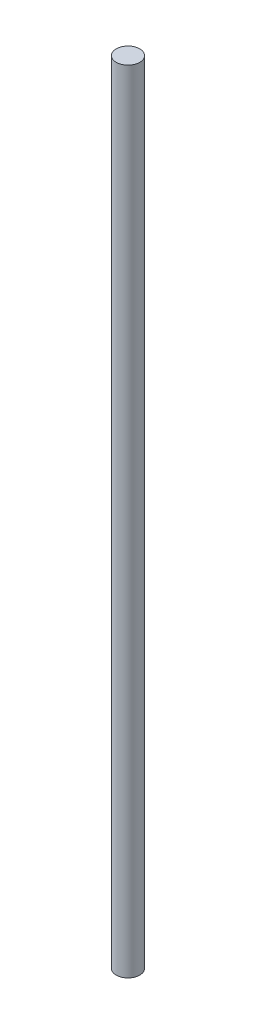
ISO-10303-21;
HEADER;
FILE_DESCRIPTION(('STEP AP214'),'2;1');
FILE_NAME('part.step','',(''),(''),'','','');
FILE_SCHEMA(('AUTOMOTIVE_DESIGN { 1 0 10303 214 1 1 1 1 }'));
ENDSEC;
DATA;
#1=APPLICATION_CONTEXT('core data for automotive mechanical design processes');
#2=APPLICATION_PROTOCOL_DEFINITION('international standard','automotive_design',2000,#1);
#3=PRODUCT_CONTEXT('',#1,'mechanical');
#4=PRODUCT('Part','Part','',(#3));
#5=PRODUCT_RELATED_PRODUCT_CATEGORY('part','',(#4));
#6=PRODUCT_DEFINITION_FORMATION('','',#4);
#7=PRODUCT_DEFINITION_CONTEXT('part definition',#1,'design');
#8=PRODUCT_DEFINITION('design','',#6,#7);
#9=PRODUCT_DEFINITION_SHAPE('','',#8);
#10=(LENGTH_UNIT() NAMED_UNIT(*) SI_UNIT(.MILLI.,.METRE.));
#11=(NAMED_UNIT(*) PLANE_ANGLE_UNIT() SI_UNIT($,.RADIAN.));
#12=(NAMED_UNIT(*) SI_UNIT($,.STERADIAN.) SOLID_ANGLE_UNIT());
#13=UNCERTAINTY_MEASURE_WITH_UNIT(LENGTH_MEASURE(1.E-05),#10,'distance_accuracy_value','');
#14=(GEOMETRIC_REPRESENTATION_CONTEXT(3) GLOBAL_UNCERTAINTY_ASSIGNED_CONTEXT((#13)) GLOBAL_UNIT_ASSIGNED_CONTEXT((#10,
#11,#12)) REPRESENTATION_CONTEXT('',''));
#15=CARTESIAN_POINT('',(0.,0.,0.));
#16=DIRECTION('',(0.,0.,1.));
#17=DIRECTION('',(1.,0.,0.));
#18=AXIS2_PLACEMENT_3D('',#15,#16,#17);
#19=CARTESIAN_POINT('',(0.,270.,0.));
#20=DIRECTION('',(0.,-1.,0.));
#21=DIRECTION('',(0.,0.,-1.));
#22=AXIS2_PLACEMENT_3D('',#19,#20,#21);
#23=CYLINDRICAL_SURFACE('',#22,4.);
#24=CARTESIAN_POINT('',(0.,270.,0.));
#25=DIRECTION('',(0.,1.,0.));
#26=DIRECTION('',(0.,0.,1.));
#27=AXIS2_PLACEMENT_3D('',#24,#25,#26);
#28=CIRCLE('',#27,4.);
#29=CARTESIAN_POINT('',(0.,270.,4.));
#30=VERTEX_POINT('',#29);
#31=EDGE_CURVE('E10',#30,#30,#28,.T.);
#32=ORIENTED_EDGE('',*,*,#31,.F.);
#33=EDGE_LOOP('',(#32));
#34=FACE_BOUND('',#33,.T.);
#35=CARTESIAN_POINT('',(0.,0.,0.));
#36=DIRECTION('',(0.,1.,0.));
#37=DIRECTION('',(0.,0.,1.));
#38=AXIS2_PLACEMENT_3D('',#35,#36,#37);
#39=CIRCLE('',#38,4.);
#40=CARTESIAN_POINT('',(0.,0.,4.));
#41=VERTEX_POINT('',#40);
#42=EDGE_CURVE('E40',#41,#41,#39,.T.);
#43=ORIENTED_EDGE('',*,*,#42,.T.);
#44=EDGE_LOOP('',(#43));
#45=FACE_BOUND('',#44,.T.);
#46=ADVANCED_FACE('F37',(#34,#45),#23,.T.);
#47=CARTESIAN_POINT('',(0.,270.,0.));
#48=DIRECTION('',(0.,1.,0.));
#49=DIRECTION('',(0.,0.,1.));
#50=AXIS2_PLACEMENT_3D('',#47,#48,#49);
#51=PLANE('',#50);
#52=ORIENTED_EDGE('',*,*,#31,.T.);
#53=EDGE_LOOP('',(#52));
#54=FACE_BOUND('',#53,.T.);
#55=ADVANCED_FACE('F54',(#54),#51,.T.);
#56=CARTESIAN_POINT('',(0.,0.,0.));
#57=DIRECTION('',(0.,1.,0.));
#58=DIRECTION('',(0.,0.,1.));
#59=AXIS2_PLACEMENT_3D('',#56,#57,#58);
#60=PLANE('',#59);
#61=ORIENTED_EDGE('',*,*,#42,.F.);
#62=EDGE_LOOP('',(#61));
#63=FACE_BOUND('',#62,.T.);
#64=ADVANCED_FACE('F52',(#63),#60,.F.);
#65=CLOSED_SHELL('',(#46,#55,#64));
#66=MANIFOLD_SOLID_BREP('B2',#65);
#67=ADVANCED_BREP_SHAPE_REPRESENTATION('',(#18,#66),#14);
#68=SHAPE_DEFINITION_REPRESENTATION(#9,#67);
ENDSEC;
END-ISO-10303-21;
